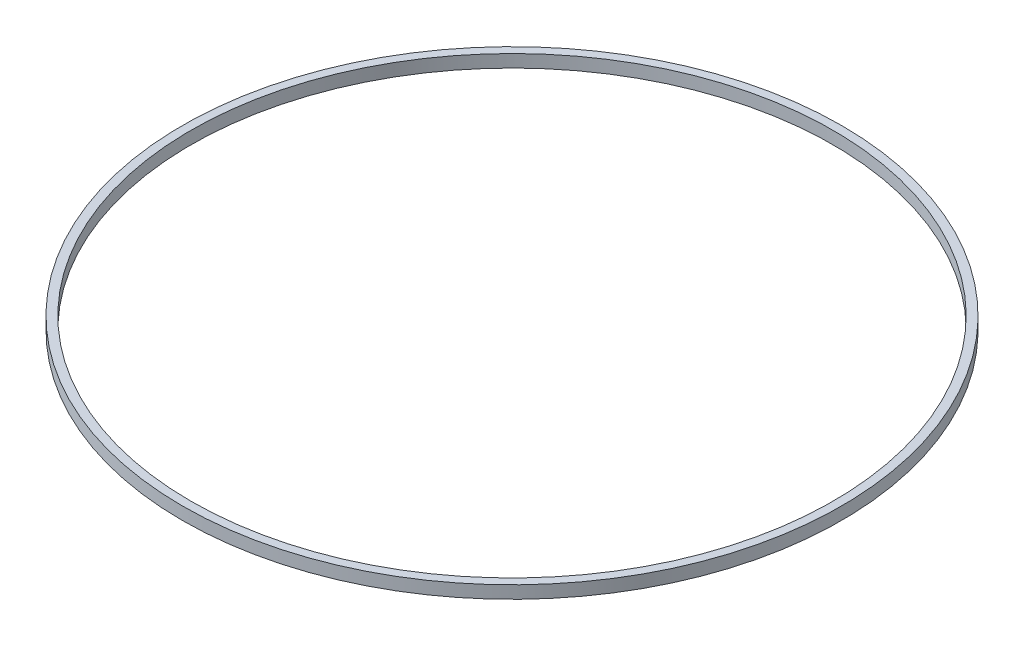
ISO-10303-21;
HEADER;
FILE_DESCRIPTION(('STEP AP214'),'2;1');
FILE_NAME('part.step','',(''),(''),'','','');
FILE_SCHEMA(('AUTOMOTIVE_DESIGN { 1 0 10303 214 1 1 1 1 }'));
ENDSEC;
DATA;
#1=APPLICATION_CONTEXT('core data for automotive mechanical design processes');
#2=APPLICATION_PROTOCOL_DEFINITION('international standard','automotive_design',2000,#1);
#3=PRODUCT_CONTEXT('',#1,'mechanical');
#4=PRODUCT('Part','Part','',(#3));
#5=PRODUCT_RELATED_PRODUCT_CATEGORY('part','',(#4));
#6=PRODUCT_DEFINITION_FORMATION('','',#4);
#7=PRODUCT_DEFINITION_CONTEXT('part definition',#1,'design');
#8=PRODUCT_DEFINITION('design','',#6,#7);
#9=PRODUCT_DEFINITION_SHAPE('','',#8);
#10=(LENGTH_UNIT() NAMED_UNIT(*) SI_UNIT(.MILLI.,.METRE.));
#11=(NAMED_UNIT(*) PLANE_ANGLE_UNIT() SI_UNIT($,.RADIAN.));
#12=(NAMED_UNIT(*) SI_UNIT($,.STERADIAN.) SOLID_ANGLE_UNIT());
#13=UNCERTAINTY_MEASURE_WITH_UNIT(LENGTH_MEASURE(1.E-05),#10,'distance_accuracy_value','');
#14=(GEOMETRIC_REPRESENTATION_CONTEXT(3) GLOBAL_UNCERTAINTY_ASSIGNED_CONTEXT((#13)) GLOBAL_UNIT_ASSIGNED_CONTEXT((#10,
#11,#12)) REPRESENTATION_CONTEXT('',''));
#15=CARTESIAN_POINT('',(0.,0.,0.));
#16=DIRECTION('',(0.,0.,1.));
#17=DIRECTION('',(1.,0.,0.));
#18=AXIS2_PLACEMENT_3D('',#15,#16,#17);
#19=CARTESIAN_POINT('',(0.,3.,0.));
#20=DIRECTION('',(0.,-1.,0.));
#21=DIRECTION('',(0.,0.,-1.));
#22=AXIS2_PLACEMENT_3D('',#19,#20,#21);
#23=CYLINDRICAL_SURFACE('',#22,78.5);
#24=CARTESIAN_POINT('',(0.,3.,0.));
#25=DIRECTION('',(0.,1.,0.));
#26=DIRECTION('',(0.,0.,1.));
#27=AXIS2_PLACEMENT_3D('',#24,#25,#26);
#28=CIRCLE('',#27,78.5);
#29=CARTESIAN_POINT('',(0.,3.,78.5));
#30=VERTEX_POINT('',#29);
#31=EDGE_CURVE('E10',#30,#30,#28,.T.);
#32=ORIENTED_EDGE('',*,*,#31,.F.);
#33=EDGE_LOOP('',(#32));
#34=FACE_BOUND('',#33,.T.);
#35=CARTESIAN_POINT('',(0.,0.,0.));
#36=DIRECTION('',(0.,1.,0.));
#37=DIRECTION('',(0.,0.,1.));
#38=AXIS2_PLACEMENT_3D('',#35,#36,#37);
#39=CIRCLE('',#38,78.5);
#40=CARTESIAN_POINT('',(0.,0.,78.5));
#41=VERTEX_POINT('',#40);
#42=EDGE_CURVE('E34',#41,#41,#39,.T.);
#43=ORIENTED_EDGE('',*,*,#42,.T.);
#44=EDGE_LOOP('',(#43));
#45=FACE_BOUND('',#44,.T.);
#46=ADVANCED_FACE('F31',(#34,#45),#23,.T.);
#47=CARTESIAN_POINT('',(0.,3.,0.));
#48=DIRECTION('',(0.,1.,0.));
#49=DIRECTION('',(0.,0.,1.));
#50=AXIS2_PLACEMENT_3D('',#47,#48,#49);
#51=PLANE('',#50);
#52=CARTESIAN_POINT('',(0.,3.,0.));
#53=DIRECTION('',(0.,1.,0.));
#54=DIRECTION('',(0.,0.,1.));
#55=AXIS2_PLACEMENT_3D('',#52,#53,#54);
#56=CIRCLE('',#55,76.5);
#57=CARTESIAN_POINT('',(0.,3.,76.5));
#58=VERTEX_POINT('',#57);
#59=EDGE_CURVE('E41',#58,#58,#56,.T.);
#60=ORIENTED_EDGE('',*,*,#59,.F.);
#61=EDGE_LOOP('',(#60));
#62=FACE_BOUND('',#61,.T.);
#63=ORIENTED_EDGE('',*,*,#31,.T.);
#64=EDGE_LOOP('',(#63));
#65=FACE_BOUND('',#64,.T.);
#66=ADVANCED_FACE('F59',(#62,#65),#51,.T.);
#67=CARTESIAN_POINT('',(0.,0.,0.));
#68=DIRECTION('',(0.,1.,0.));
#69=DIRECTION('',(0.,0.,1.));
#70=AXIS2_PLACEMENT_3D('',#67,#68,#69);
#71=PLANE('',#70);
#72=CARTESIAN_POINT('',(0.,0.,0.));
#73=DIRECTION('',(0.,1.,0.));
#74=DIRECTION('',(0.,0.,1.));
#75=AXIS2_PLACEMENT_3D('',#72,#73,#74);
#76=CIRCLE('',#75,76.5);
#77=CARTESIAN_POINT('',(0.,0.,76.5));
#78=VERTEX_POINT('',#77);
#79=EDGE_CURVE('E45',#78,#78,#76,.T.);
#80=ORIENTED_EDGE('',*,*,#79,.T.);
#81=EDGE_LOOP('',(#80));
#82=FACE_BOUND('',#81,.T.);
#83=ORIENTED_EDGE('',*,*,#42,.F.);
#84=EDGE_LOOP('',(#83));
#85=FACE_BOUND('',#84,.T.);
#86=ADVANCED_FACE('F49',(#82,#85),#71,.F.);
#87=CARTESIAN_POINT('',(0.,0.,0.));
#88=DIRECTION('',(0.,1.,0.));
#89=DIRECTION('',(0.,0.,1.));
#90=AXIS2_PLACEMENT_3D('',#87,#88,#89);
#91=CYLINDRICAL_SURFACE('',#90,76.5);
#92=ORIENTED_EDGE('',*,*,#59,.T.);
#93=EDGE_LOOP('',(#92));
#94=FACE_BOUND('',#93,.T.);
#95=ORIENTED_EDGE('',*,*,#79,.F.);
#96=EDGE_LOOP('',(#95));
#97=FACE_BOUND('',#96,.T.);
#98=ADVANCED_FACE('F52',(#94,#97),#91,.F.);
#99=CLOSED_SHELL('',(#46,#66,#86,#98));
#100=MANIFOLD_SOLID_BREP('B2',#99);
#101=ADVANCED_BREP_SHAPE_REPRESENTATION('',(#18,#100),#14);
#102=SHAPE_DEFINITION_REPRESENTATION(#9,#101);
ENDSEC;
END-ISO-10303-21;
